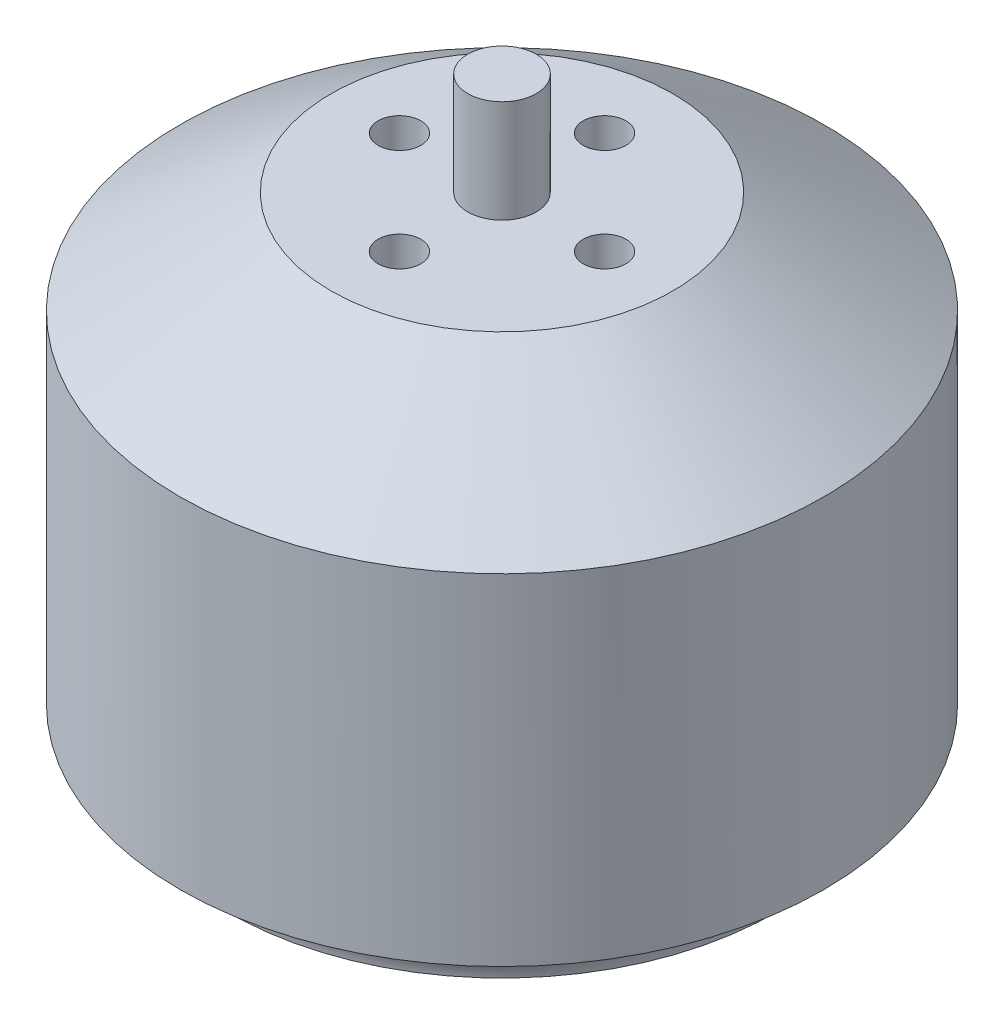
ISO-10303-21;
HEADER;
FILE_DESCRIPTION(('STEP AP214'),'2;1');
FILE_NAME('part.step','',(''),(''),'','','');
FILE_SCHEMA(('AUTOMOTIVE_DESIGN { 1 0 10303 214 1 1 1 1 }'));
ENDSEC;
DATA;
#1=APPLICATION_CONTEXT('core data for automotive mechanical design processes');
#2=APPLICATION_PROTOCOL_DEFINITION('international standard','automotive_design',2000,#1);
#3=PRODUCT_CONTEXT('',#1,'mechanical');
#4=PRODUCT('Part','Part','',(#3));
#5=PRODUCT_RELATED_PRODUCT_CATEGORY('part','',(#4));
#6=PRODUCT_DEFINITION_FORMATION('','',#4);
#7=PRODUCT_DEFINITION_CONTEXT('part definition',#1,'design');
#8=PRODUCT_DEFINITION('design','',#6,#7);
#9=PRODUCT_DEFINITION_SHAPE('','',#8);
#10=(LENGTH_UNIT() NAMED_UNIT(*) SI_UNIT(.MILLI.,.METRE.));
#11=(NAMED_UNIT(*) PLANE_ANGLE_UNIT() SI_UNIT($,.RADIAN.));
#12=(NAMED_UNIT(*) SI_UNIT($,.STERADIAN.) SOLID_ANGLE_UNIT());
#13=UNCERTAINTY_MEASURE_WITH_UNIT(LENGTH_MEASURE(1.E-05),#10,'distance_accuracy_value','');
#14=(GEOMETRIC_REPRESENTATION_CONTEXT(3) GLOBAL_UNCERTAINTY_ASSIGNED_CONTEXT((#13)) GLOBAL_UNIT_ASSIGNED_CONTEXT((#10,
#11,#12)) REPRESENTATION_CONTEXT('',''));
#15=CARTESIAN_POINT('',(0.,0.,0.));
#16=DIRECTION('',(0.,0.,1.));
#17=DIRECTION('',(1.,0.,0.));
#18=AXIS2_PLACEMENT_3D('',#15,#16,#17);
#19=CARTESIAN_POINT('',(0.,0.,0.));
#20=DIRECTION('',(0.,1.,0.));
#21=DIRECTION('',(0.,0.,-1.));
#22=AXIS2_PLACEMENT_3D('',#19,#20,#21);
#23=PLANE('',#22);
#24=CARTESIAN_POINT('',(0.,0.,0.));
#25=DIRECTION('',(0.,-1.,0.));
#26=DIRECTION('',(0.,0.,-1.));
#27=AXIS2_PLACEMENT_3D('',#24,#25,#26);
#28=CIRCLE('',#27,16.);
#29=CARTESIAN_POINT('',(0.,0.,-16.));
#30=VERTEX_POINT('',#29);
#31=EDGE_CURVE('E124',#30,#30,#28,.T.);
#32=ORIENTED_EDGE('',*,*,#31,.T.);
#33=EDGE_LOOP('',(#32));
#34=FACE_BOUND('',#33,.T.);
#35=CARTESIAN_POINT('',(0.,0.,-9.5));
#36=DIRECTION('',(0.,1.,0.));
#37=DIRECTION('',(0.,0.,1.));
#38=AXIS2_PLACEMENT_3D('',#35,#36,#37);
#39=CIRCLE('',#38,1.24999999999999);
#40=CARTESIAN_POINT('',(0.,0.,-8.25000000000001));
#41=VERTEX_POINT('',#40);
#42=EDGE_CURVE('E127',#41,#41,#39,.T.);
#43=ORIENTED_EDGE('',*,*,#42,.T.);
#44=EDGE_LOOP('',(#43));
#45=FACE_BOUND('',#44,.T.);
#46=CARTESIAN_POINT('',(12.5,0.,0.));
#47=DIRECTION('',(0.,1.,0.));
#48=DIRECTION('',(0.,0.,1.));
#49=AXIS2_PLACEMENT_3D('',#46,#47,#48);
#50=CIRCLE('',#49,1.24999999999999);
#51=CARTESIAN_POINT('',(12.5,0.,1.24999999999999));
#52=VERTEX_POINT('',#51);
#53=EDGE_CURVE('E143',#52,#52,#50,.T.);
#54=ORIENTED_EDGE('',*,*,#53,.T.);
#55=EDGE_LOOP('',(#54));
#56=FACE_BOUND('',#55,.T.);
#57=CARTESIAN_POINT('',(0.,0.,9.5));
#58=DIRECTION('',(0.,1.,0.));
#59=DIRECTION('',(0.,0.,1.));
#60=AXIS2_PLACEMENT_3D('',#57,#58,#59);
#61=CIRCLE('',#60,1.24999999999999);
#62=CARTESIAN_POINT('',(0.,0.,10.75));
#63=VERTEX_POINT('',#62);
#64=EDGE_CURVE('E149',#63,#63,#61,.T.);
#65=ORIENTED_EDGE('',*,*,#64,.T.);
#66=EDGE_LOOP('',(#65));
#67=FACE_BOUND('',#66,.T.);
#68=CARTESIAN_POINT('',(-8.,0.,0.));
#69=DIRECTION('',(0.,1.,0.));
#70=DIRECTION('',(0.,0.,1.));
#71=AXIS2_PLACEMENT_3D('',#68,#69,#70);
#72=CIRCLE('',#71,1.24999999999999);
#73=CARTESIAN_POINT('',(-8.,0.,1.24999999999999));
#74=VERTEX_POINT('',#73);
#75=EDGE_CURVE('E155',#74,#74,#72,.T.);
#76=ORIENTED_EDGE('',*,*,#75,.T.);
#77=EDGE_LOOP('',(#76));
#78=FACE_BOUND('',#77,.T.);
#79=CARTESIAN_POINT('',(-12.5,0.,0.));
#80=DIRECTION('',(0.,1.,0.));
#81=DIRECTION('',(0.,0.,1.));
#82=AXIS2_PLACEMENT_3D('',#79,#80,#81);
#83=CIRCLE('',#82,1.24999999999999);
#84=CARTESIAN_POINT('',(-12.5,0.,1.24999999999999));
#85=VERTEX_POINT('',#84);
#86=EDGE_CURVE('E161',#85,#85,#83,.T.);
#87=ORIENTED_EDGE('',*,*,#86,.T.);
#88=EDGE_LOOP('',(#87));
#89=FACE_BOUND('',#88,.T.);
#90=CARTESIAN_POINT('',(0.,0.,0.));
#91=DIRECTION('',(0.,-1.,0.));
#92=DIRECTION('',(0.,0.,-1.));
#93=AXIS2_PLACEMENT_3D('',#90,#91,#92);
#94=CIRCLE('',#93,2.);
#95=CARTESIAN_POINT('',(0.,0.,-2.));
#96=VERTEX_POINT('',#95);
#97=EDGE_CURVE('E11',#96,#96,#94,.F.);
#98=ORIENTED_EDGE('',*,*,#97,.T.);
#99=EDGE_LOOP('',(#98));
#100=FACE_BOUND('',#99,.T.);
#101=CARTESIAN_POINT('',(8.,0.,0.));
#102=DIRECTION('',(0.,1.,0.));
#103=DIRECTION('',(0.,0.,1.));
#104=AXIS2_PLACEMENT_3D('',#101,#102,#103);
#105=CIRCLE('',#104,1.24999999999999);
#106=CARTESIAN_POINT('',(8.,0.,1.24999999999999));
#107=VERTEX_POINT('',#106);
#108=EDGE_CURVE('E137',#107,#107,#105,.T.);
#109=ORIENTED_EDGE('',*,*,#108,.T.);
#110=EDGE_LOOP('',(#109));
#111=FACE_BOUND('',#110,.T.);
#112=ADVANCED_FACE('F47',(#34,#45,#56,#67,#78,#89,#100,#111),#23,.F.);
#113=CARTESIAN_POINT('',(0.,-2.6,0.));
#114=DIRECTION('',(0.,1.,0.));
#115=DIRECTION('',(0.,0.,-1.));
#116=AXIS2_PLACEMENT_3D('',#113,#114,#115);
#117=CYLINDRICAL_SURFACE('',#116,2.);
#118=CARTESIAN_POINT('',(0.,-2.6,0.));
#119=DIRECTION('',(0.,1.,0.));
#120=DIRECTION('',(0.,0.,1.));
#121=AXIS2_PLACEMENT_3D('',#118,#119,#120);
#122=CIRCLE('',#121,2.);
#123=CARTESIAN_POINT('',(0.,-2.6,2.));
#124=VERTEX_POINT('',#123);
#125=EDGE_CURVE('E167',#124,#124,#122,.T.);
#126=ORIENTED_EDGE('',*,*,#125,.T.);
#127=EDGE_LOOP('',(#126));
#128=FACE_BOUND('',#127,.T.);
#129=ORIENTED_EDGE('',*,*,#97,.F.);
#130=EDGE_LOOP('',(#129));
#131=FACE_BOUND('',#130,.T.);
#132=ADVANCED_FACE('F194',(#128,#131),#117,.T.);
#133=CARTESIAN_POINT('',(0.,-2.6,0.));
#134=DIRECTION('',(0.,-1.,0.));
#135=DIRECTION('',(0.,0.,1.));
#136=AXIS2_PLACEMENT_3D('',#133,#134,#135);
#137=PLANE('',#136);
#138=ORIENTED_EDGE('',*,*,#125,.F.);
#139=EDGE_LOOP('',(#138));
#140=FACE_BOUND('',#139,.T.);
#141=ADVANCED_FACE('F199',(#140),#137,.T.);
#142=CARTESIAN_POINT('',(-12.5,1.64892422621555,0.));
#143=DIRECTION('',(0.,-1.,0.));
#144=DIRECTION('',(0.,0.,1.));
#145=AXIS2_PLACEMENT_3D('',#142,#143,#144);
#146=CONICAL_SURFACE('',#145,1.25,1.02974425867665);
#147=CARTESIAN_POINT('',(-12.5,2.4,0.));
#148=VERTEX_POINT('',#147);
#149=VERTEX_LOOP('',#148);
#150=FACE_BOUND('',#149,.T.);
#151=CARTESIAN_POINT('',(-12.5,1.64892422621555,0.));
#152=DIRECTION('',(0.,1.,0.));
#153=DIRECTION('',(0.,0.,1.));
#154=AXIS2_PLACEMENT_3D('',#151,#152,#153);
#155=CIRCLE('',#154,1.25);
#156=CARTESIAN_POINT('',(-12.5,1.64892422621555,1.25));
#157=VERTEX_POINT('',#156);
#158=EDGE_CURVE('E164',#157,#157,#155,.T.);
#159=ORIENTED_EDGE('',*,*,#158,.F.);
#160=EDGE_LOOP('',(#159));
#161=FACE_BOUND('',#160,.T.);
#162=ADVANCED_FACE('F261',(#150,#161),#146,.F.);
#163=CARTESIAN_POINT('',(-12.5,0.,0.));
#164=DIRECTION('',(0.,-1.,0.));
#165=DIRECTION('',(0.,0.,1.));
#166=AXIS2_PLACEMENT_3D('',#163,#164,#165);
#167=CYLINDRICAL_SURFACE('',#166,1.24999999999999);
#168=ORIENTED_EDGE('',*,*,#158,.T.);
#169=EDGE_LOOP('',(#168));
#170=FACE_BOUND('',#169,.T.);
#171=ORIENTED_EDGE('',*,*,#86,.F.);
#172=EDGE_LOOP('',(#171));
#173=FACE_BOUND('',#172,.T.);
#174=ADVANCED_FACE('F258',(#170,#173),#167,.F.);
#175=CARTESIAN_POINT('',(-8.,1.64892422621555,0.));
#176=DIRECTION('',(0.,-1.,0.));
#177=DIRECTION('',(0.,0.,1.));
#178=AXIS2_PLACEMENT_3D('',#175,#176,#177);
#179=CONICAL_SURFACE('',#178,1.25,1.02974425867665);
#180=CARTESIAN_POINT('',(-8.,2.4,0.));
#181=VERTEX_POINT('',#180);
#182=VERTEX_LOOP('',#181);
#183=FACE_BOUND('',#182,.T.);
#184=CARTESIAN_POINT('',(-8.,1.64892422621555,0.));
#185=DIRECTION('',(0.,1.,0.));
#186=DIRECTION('',(0.,0.,1.));
#187=AXIS2_PLACEMENT_3D('',#184,#185,#186);
#188=CIRCLE('',#187,1.25);
#189=CARTESIAN_POINT('',(-8.,1.64892422621555,1.25));
#190=VERTEX_POINT('',#189);
#191=EDGE_CURVE('E158',#190,#190,#188,.T.);
#192=ORIENTED_EDGE('',*,*,#191,.F.);
#193=EDGE_LOOP('',(#192));
#194=FACE_BOUND('',#193,.T.);
#195=ADVANCED_FACE('F254',(#183,#194),#179,.F.);
#196=CARTESIAN_POINT('',(-8.,0.,0.));
#197=DIRECTION('',(0.,-1.,0.));
#198=DIRECTION('',(0.,0.,1.));
#199=AXIS2_PLACEMENT_3D('',#196,#197,#198);
#200=CYLINDRICAL_SURFACE('',#199,1.24999999999999);
#201=ORIENTED_EDGE('',*,*,#191,.T.);
#202=EDGE_LOOP('',(#201));
#203=FACE_BOUND('',#202,.T.);
#204=ORIENTED_EDGE('',*,*,#75,.F.);
#205=EDGE_LOOP('',(#204));
#206=FACE_BOUND('',#205,.T.);
#207=ADVANCED_FACE('F250',(#203,#206),#200,.F.);
#208=CARTESIAN_POINT('',(0.,1.64892422621555,9.5));
#209=DIRECTION('',(0.,-1.,0.));
#210=DIRECTION('',(0.,0.,1.));
#211=AXIS2_PLACEMENT_3D('',#208,#209,#210);
#212=CONICAL_SURFACE('',#211,1.25,1.02974425867665);
#213=CARTESIAN_POINT('',(0.,2.4,9.5));
#214=VERTEX_POINT('',#213);
#215=VERTEX_LOOP('',#214);
#216=FACE_BOUND('',#215,.T.);
#217=CARTESIAN_POINT('',(0.,1.64892422621555,9.5));
#218=DIRECTION('',(0.,1.,0.));
#219=DIRECTION('',(0.,0.,1.));
#220=AXIS2_PLACEMENT_3D('',#217,#218,#219);
#221=CIRCLE('',#220,1.25);
#222=CARTESIAN_POINT('',(0.,1.64892422621555,10.75));
#223=VERTEX_POINT('',#222);
#224=EDGE_CURVE('E152',#223,#223,#221,.T.);
#225=ORIENTED_EDGE('',*,*,#224,.F.);
#226=EDGE_LOOP('',(#225));
#227=FACE_BOUND('',#226,.T.);
#228=ADVANCED_FACE('F246',(#216,#227),#212,.F.);
#229=CARTESIAN_POINT('',(0.,0.,9.5));
#230=DIRECTION('',(0.,-1.,0.));
#231=DIRECTION('',(0.,0.,1.));
#232=AXIS2_PLACEMENT_3D('',#229,#230,#231);
#233=CYLINDRICAL_SURFACE('',#232,1.24999999999999);
#234=ORIENTED_EDGE('',*,*,#224,.T.);
#235=EDGE_LOOP('',(#234));
#236=FACE_BOUND('',#235,.T.);
#237=ORIENTED_EDGE('',*,*,#64,.F.);
#238=EDGE_LOOP('',(#237));
#239=FACE_BOUND('',#238,.T.);
#240=ADVANCED_FACE('F242',(#236,#239),#233,.F.);
#241=CARTESIAN_POINT('',(12.5,1.64892422621555,0.));
#242=DIRECTION('',(0.,-1.,0.));
#243=DIRECTION('',(0.,0.,1.));
#244=AXIS2_PLACEMENT_3D('',#241,#242,#243);
#245=CONICAL_SURFACE('',#244,1.25,1.02974425867665);
#246=CARTESIAN_POINT('',(12.5,2.4,0.));
#247=VERTEX_POINT('',#246);
#248=VERTEX_LOOP('',#247);
#249=FACE_BOUND('',#248,.T.);
#250=CARTESIAN_POINT('',(12.5,1.64892422621555,0.));
#251=DIRECTION('',(0.,1.,0.));
#252=DIRECTION('',(0.,0.,1.));
#253=AXIS2_PLACEMENT_3D('',#250,#251,#252);
#254=CIRCLE('',#253,1.25);
#255=CARTESIAN_POINT('',(12.5,1.64892422621555,1.25));
#256=VERTEX_POINT('',#255);
#257=EDGE_CURVE('E146',#256,#256,#254,.T.);
#258=ORIENTED_EDGE('',*,*,#257,.F.);
#259=EDGE_LOOP('',(#258));
#260=FACE_BOUND('',#259,.T.);
#261=ADVANCED_FACE('F238',(#249,#260),#245,.F.);
#262=CARTESIAN_POINT('',(12.5,0.,0.));
#263=DIRECTION('',(0.,-1.,0.));
#264=DIRECTION('',(0.,0.,1.));
#265=AXIS2_PLACEMENT_3D('',#262,#263,#264);
#266=CYLINDRICAL_SURFACE('',#265,1.24999999999999);
#267=ORIENTED_EDGE('',*,*,#257,.T.);
#268=EDGE_LOOP('',(#267));
#269=FACE_BOUND('',#268,.T.);
#270=ORIENTED_EDGE('',*,*,#53,.F.);
#271=EDGE_LOOP('',(#270));
#272=FACE_BOUND('',#271,.T.);
#273=ADVANCED_FACE('F231',(#269,#272),#266,.F.);
#274=CARTESIAN_POINT('',(8.,1.64892422621555,0.));
#275=DIRECTION('',(0.,-1.,0.));
#276=DIRECTION('',(0.,0.,1.));
#277=AXIS2_PLACEMENT_3D('',#274,#275,#276);
#278=CONICAL_SURFACE('',#277,1.25,1.02974425867665);
#279=CARTESIAN_POINT('',(8.,2.4,0.));
#280=VERTEX_POINT('',#279);
#281=VERTEX_LOOP('',#280);
#282=FACE_BOUND('',#281,.T.);
#283=CARTESIAN_POINT('',(8.,1.64892422621555,0.));
#284=DIRECTION('',(0.,1.,0.));
#285=DIRECTION('',(0.,0.,1.));
#286=AXIS2_PLACEMENT_3D('',#283,#284,#285);
#287=CIRCLE('',#286,1.25);
#288=CARTESIAN_POINT('',(8.,1.64892422621555,1.25));
#289=VERTEX_POINT('',#288);
#290=EDGE_CURVE('E140',#289,#289,#287,.T.);
#291=ORIENTED_EDGE('',*,*,#290,.F.);
#292=EDGE_LOOP('',(#291));
#293=FACE_BOUND('',#292,.T.);
#294=ADVANCED_FACE('F221',(#282,#293),#278,.F.);
#295=CARTESIAN_POINT('',(8.,0.,0.));
#296=DIRECTION('',(0.,-1.,0.));
#297=DIRECTION('',(0.,0.,1.));
#298=AXIS2_PLACEMENT_3D('',#295,#296,#297);
#299=CYLINDRICAL_SURFACE('',#298,1.24999999999999);
#300=ORIENTED_EDGE('',*,*,#290,.T.);
#301=EDGE_LOOP('',(#300));
#302=FACE_BOUND('',#301,.T.);
#303=ORIENTED_EDGE('',*,*,#108,.F.);
#304=EDGE_LOOP('',(#303));
#305=FACE_BOUND('',#304,.T.);
#306=ADVANCED_FACE('F218',(#302,#305),#299,.F.);
#307=CARTESIAN_POINT('',(0.,1.64892422621555,-9.5));
#308=DIRECTION('',(0.,-1.,0.));
#309=DIRECTION('',(0.,0.,1.));
#310=AXIS2_PLACEMENT_3D('',#307,#308,#309);
#311=CONICAL_SURFACE('',#310,1.25,1.02974425867665);
#312=CARTESIAN_POINT('',(0.,2.4,-9.5));
#313=VERTEX_POINT('',#312);
#314=VERTEX_LOOP('',#313);
#315=FACE_BOUND('',#314,.T.);
#316=CARTESIAN_POINT('',(0.,1.64892422621555,-9.5));
#317=DIRECTION('',(0.,1.,0.));
#318=DIRECTION('',(0.,0.,1.));
#319=AXIS2_PLACEMENT_3D('',#316,#317,#318);
#320=CIRCLE('',#319,1.25);
#321=CARTESIAN_POINT('',(0.,1.64892422621555,-8.25));
#322=VERTEX_POINT('',#321);
#323=EDGE_CURVE('E134',#322,#322,#320,.T.);
#324=ORIENTED_EDGE('',*,*,#323,.F.);
#325=EDGE_LOOP('',(#324));
#326=FACE_BOUND('',#325,.T.);
#327=ADVANCED_FACE('F220',(#315,#326),#311,.F.);
#328=CARTESIAN_POINT('',(0.,0.,-9.5));
#329=DIRECTION('',(0.,-1.,0.));
#330=DIRECTION('',(0.,0.,1.));
#331=AXIS2_PLACEMENT_3D('',#328,#329,#330);
#332=CYLINDRICAL_SURFACE('',#331,1.24999999999999);
#333=ORIENTED_EDGE('',*,*,#323,.T.);
#334=EDGE_LOOP('',(#333));
#335=FACE_BOUND('',#334,.T.);
#336=ORIENTED_EDGE('',*,*,#42,.F.);
#337=EDGE_LOOP('',(#336));
#338=FACE_BOUND('',#337,.T.);
#339=ADVANCED_FACE('F228',(#335,#338),#332,.F.);
#340=CARTESIAN_POINT('',(0.,-0.262019230769191,0.));
#341=DIRECTION('',(0.,1.,0.));
#342=DIRECTION('',(0.,0.,-1.));
#343=AXIS2_PLACEMENT_3D('',#340,#341,#342);
#344=TOROIDAL_SURFACE('',#343,18.85,2.8620192307692);
#345=CARTESIAN_POINT('',(0.,2.60000000000002,0.));
#346=DIRECTION('',(0.,-1.,0.));
#347=DIRECTION('',(0.,0.,-1.));
#348=AXIS2_PLACEMENT_3D('',#345,#346,#347);
#349=CIRCLE('',#348,18.85);
#350=CARTESIAN_POINT('',(0.,2.60000000000002,18.85));
#351=VERTEX_POINT('',#350);
#352=EDGE_CURVE('E119',#351,#351,#349,.T.);
#353=ORIENTED_EDGE('',*,*,#352,.T.);
#354=EDGE_LOOP('',(#353));
#355=FACE_BOUND('',#354,.T.);
#356=ORIENTED_EDGE('',*,*,#31,.F.);
#357=EDGE_LOOP('',(#356));
#358=FACE_BOUND('',#357,.T.);
#359=ADVANCED_FACE('F344',(#355,#358),#344,.F.);
#360=CARTESIAN_POINT('',(0.,28.5,0.));
#361=DIRECTION('',(0.,-1.,0.));
#362=DIRECTION('',(0.,0.,1.));
#363=AXIS2_PLACEMENT_3D('',#360,#361,#362);
#364=CYLINDRICAL_SURFACE('',#363,18.85);
#365=CARTESIAN_POINT('',(0.,22.5,0.));
#366=DIRECTION('',(0.,-1.,0.));
#367=DIRECTION('',(0.,0.,-1.));
#368=AXIS2_PLACEMENT_3D('',#365,#366,#367);
#369=CIRCLE('',#368,18.85);
#370=CARTESIAN_POINT('',(0.,22.5,18.85));
#371=VERTEX_POINT('',#370);
#372=EDGE_CURVE('E120',#371,#371,#369,.T.);
#373=CARTESIAN_POINT('',(0.,22.5,18.85));
#374=CARTESIAN_POINT('',(0.,22.2927083333333,18.85));
#375=CARTESIAN_POINT('',(0.,22.0854166666667,18.85));
#376=CARTESIAN_POINT('',(0.,21.6708333333333,18.85));
#377=CARTESIAN_POINT('',(0.,21.4635416666667,18.85));
#378=CARTESIAN_POINT('',(0.,21.0489583333333,18.85));
#379=CARTESIAN_POINT('',(0.,20.8416666666667,18.85));
#380=CARTESIAN_POINT('',(0.,20.4270833333333,18.85));
#381=CARTESIAN_POINT('',(0.,20.2197916666667,18.85));
#382=CARTESIAN_POINT('',(0.,19.8052083333333,18.85));
#383=CARTESIAN_POINT('',(0.,19.5979166666667,18.85));
#384=CARTESIAN_POINT('',(0.,19.1833333333333,18.85));
#385=CARTESIAN_POINT('',(0.,18.9760416666667,18.85));
#386=CARTESIAN_POINT('',(0.,18.5614583333333,18.85));
#387=CARTESIAN_POINT('',(0.,18.3541666666667,18.85));
#388=CARTESIAN_POINT('',(0.,17.9395833333333,18.85));
#389=CARTESIAN_POINT('',(0.,17.7322916666667,18.85));
#390=CARTESIAN_POINT('',(0.,17.3177083333333,18.85));
#391=CARTESIAN_POINT('',(0.,17.1104166666667,18.85));
#392=CARTESIAN_POINT('',(0.,16.6958333333333,18.85));
#393=CARTESIAN_POINT('',(0.,16.4885416666667,18.85));
#394=CARTESIAN_POINT('',(0.,16.0739583333333,18.85));
#395=CARTESIAN_POINT('',(0.,15.8666666666667,18.85));
#396=CARTESIAN_POINT('',(0.,15.4520833333333,18.85));
#397=CARTESIAN_POINT('',(0.,15.2447916666667,18.85));
#398=CARTESIAN_POINT('',(0.,14.8302083333333,18.85));
#399=CARTESIAN_POINT('',(0.,14.6229166666667,18.85));
#400=CARTESIAN_POINT('',(0.,14.2083333333333,18.85));
#401=CARTESIAN_POINT('',(0.,14.0010416666667,18.85));
#402=CARTESIAN_POINT('',(0.,13.5864583333333,18.85));
#403=CARTESIAN_POINT('',(0.,13.3791666666667,18.85));
#404=CARTESIAN_POINT('',(0.,12.9645833333333,18.85));
#405=CARTESIAN_POINT('',(0.,12.7572916666667,18.85));
#406=CARTESIAN_POINT('',(0.,12.3427083333333,18.85));
#407=CARTESIAN_POINT('',(0.,12.1354166666667,18.85));
#408=CARTESIAN_POINT('',(0.,11.7208333333333,18.85));
#409=CARTESIAN_POINT('',(0.,11.5135416666667,18.85));
#410=CARTESIAN_POINT('',(0.,11.0989583333333,18.85));
#411=CARTESIAN_POINT('',(0.,10.8916666666667,18.85));
#412=CARTESIAN_POINT('',(0.,10.4770833333333,18.85));
#413=CARTESIAN_POINT('',(0.,10.2697916666667,18.85));
#414=CARTESIAN_POINT('',(0.,9.85520833333335,18.85));
#415=CARTESIAN_POINT('',(0.,9.64791666666668,18.85));
#416=CARTESIAN_POINT('',(0.,9.23333333333335,18.85));
#417=CARTESIAN_POINT('',(0.,9.02604166666668,18.85));
#418=CARTESIAN_POINT('',(0.,8.61145833333335,18.85));
#419=CARTESIAN_POINT('',(0.,8.40416666666668,18.85));
#420=CARTESIAN_POINT('',(0.,7.98958333333335,18.85));
#421=CARTESIAN_POINT('',(0.,7.78229166666668,18.85));
#422=CARTESIAN_POINT('',(0.,7.36770833333335,18.85));
#423=CARTESIAN_POINT('',(0.,7.16041666666668,18.85));
#424=CARTESIAN_POINT('',(0.,6.74583333333335,18.85));
#425=CARTESIAN_POINT('',(0.,6.53854166666668,18.85));
#426=CARTESIAN_POINT('',(0.,6.12395833333335,18.85));
#427=CARTESIAN_POINT('',(0.,5.91666666666668,18.85));
#428=CARTESIAN_POINT('',(0.,5.50208333333335,18.85));
#429=CARTESIAN_POINT('',(0.,5.29479166666668,18.85));
#430=CARTESIAN_POINT('',(0.,4.88020833333335,18.85));
#431=CARTESIAN_POINT('',(0.,4.67291666666668,18.85));
#432=CARTESIAN_POINT('',(0.,4.25833333333335,18.85));
#433=CARTESIAN_POINT('',(0.,4.05104166666668,18.85));
#434=CARTESIAN_POINT('',(0.,3.63645833333335,18.85));
#435=CARTESIAN_POINT('',(0.,3.42916666666668,18.85));
#436=CARTESIAN_POINT('',(0.,3.01458333333335,18.85));
#437=CARTESIAN_POINT('',(0.,2.80729166666669,18.85));
#438=CARTESIAN_POINT('',(0.,2.60000000000002,18.85));
#439=B_SPLINE_CURVE_WITH_KNOTS('',3,(#373,#374,#375,#376,#377,#378,#379,#380,#381,#382,#383,
#384,#385,#386,#387,#388,#389,#390,#391,#392,#393,#394,#395,#396,#397,#398,#399,#400,#401,#402,
#403,#404,#405,#406,#407,#408,#409,#410,#411,#412,#413,#414,#415,#416,#417,#418,#419,#420,#421,
#422,#423,#424,#425,#426,#427,#428,#429,#430,#431,#432,#433,#434,#435,#436,#437,#438),
.UNSPECIFIED.,.F.,.F.,(4,2,2,2,2,2,2,2,2,2,2,2,2,2,2,2,2,2,2,2,2,2,2,2,2,2,2,2,2,2,2,2,4),(0.,
0.621875000000001,1.24375,1.865625,2.4875,3.109375,3.73124999999999,4.353125,4.975,5.596875,
6.21875,6.840625,7.4625,8.08437499999999,8.70625,9.32812499999999,9.94999999999999,10.571875,
11.19375,11.815625,12.4375,13.059375,13.68125,14.303125,14.925,15.546875,16.16875,16.790625,
17.4125,18.034375,18.65625,19.278125,19.9),.UNSPECIFIED.);
#440=EDGE_CURVE('BSEAM49',#371,#351,#439,.T.);
#441=ORIENTED_EDGE('',*,*,#372,.T.);
#442=ORIENTED_EDGE('',*,*,#352,.F.);
#443=ORIENTED_EDGE('',*,*,#440,.T.);
#444=ORIENTED_EDGE('',*,*,#440,.F.);
#445=EDGE_LOOP('',(#441,#443,#442,#444));
#446=FACE_BOUND('',#445,.T.);
#447=ADVANCED_FACE('F49',(#446),#364,.T.);
#448=CARTESIAN_POINT('',(0.,22.5,0.));
#449=DIRECTION('',(0.,-1.,0.));
#450=DIRECTION('',(0.,0.,1.));
#451=AXIS2_PLACEMENT_3D('',#448,#449,#450);
#452=CONICAL_SURFACE('',#451,18.85,0.975011779171836);
#453=CARTESIAN_POINT('',(0.,28.5,0.));
#454=DIRECTION('',(0.,-1.,0.));
#455=DIRECTION('',(0.,0.,-1.));
#456=AXIS2_PLACEMENT_3D('',#453,#454,#455);
#457=CIRCLE('',#456,10.);
#458=CARTESIAN_POINT('',(0.,28.5,-10.));
#459=VERTEX_POINT('',#458);
#460=EDGE_CURVE('E123',#459,#459,#457,.T.);
#461=ORIENTED_EDGE('',*,*,#460,.T.);
#462=EDGE_LOOP('',(#461));
#463=FACE_BOUND('',#462,.T.);
#464=ORIENTED_EDGE('',*,*,#372,.F.);
#465=EDGE_LOOP('',(#464));
#466=FACE_BOUND('',#465,.T.);
#467=ADVANCED_FACE('F190',(#463,#466),#452,.T.);
#468=CARTESIAN_POINT('',(0.,34.5,0.));
#469=DIRECTION('',(0.,1.,0.));
#470=DIRECTION('',(0.,0.,-1.));
#471=AXIS2_PLACEMENT_3D('',#468,#469,#470);
#472=PLANE('',#471);
#473=CARTESIAN_POINT('',(0.,34.5,0.));
#474=DIRECTION('',(0.,-1.,0.));
#475=DIRECTION('',(0.,0.,-1.));
#476=AXIS2_PLACEMENT_3D('',#473,#474,#475);
#477=CIRCLE('',#476,2.);
#478=CARTESIAN_POINT('',(0.,34.5,-2.));
#479=VERTEX_POINT('',#478);
#480=EDGE_CURVE('E55',#479,#479,#477,.T.);
#481=ORIENTED_EDGE('',*,*,#480,.F.);
#482=EDGE_LOOP('',(#481));
#483=FACE_BOUND('',#482,.T.);
#484=ADVANCED_FACE('F180',(#483),#472,.T.);
#485=CARTESIAN_POINT('',(0.,34.5,0.));
#486=DIRECTION('',(0.,-1.,0.));
#487=DIRECTION('',(0.,0.,1.));
#488=AXIS2_PLACEMENT_3D('',#485,#486,#487);
#489=CYLINDRICAL_SURFACE('',#488,2.);
#490=ORIENTED_EDGE('',*,*,#480,.T.);
#491=EDGE_LOOP('',(#490));
#492=FACE_BOUND('',#491,.T.);
#493=CARTESIAN_POINT('',(0.,28.5,0.));
#494=DIRECTION('',(0.,-1.,0.));
#495=DIRECTION('',(0.,0.,-1.));
#496=AXIS2_PLACEMENT_3D('',#493,#494,#495);
#497=CIRCLE('',#496,2.);
#498=CARTESIAN_POINT('',(0.,28.5,-2.));
#499=VERTEX_POINT('',#498);
#500=EDGE_CURVE('E170',#499,#499,#497,.T.);
#501=ORIENTED_EDGE('',*,*,#500,.F.);
#502=EDGE_LOOP('',(#501));
#503=FACE_BOUND('',#502,.T.);
#504=ADVANCED_FACE('F178',(#492,#503),#489,.T.);
#505=CARTESIAN_POINT('',(0.,28.5,0.));
#506=DIRECTION('',(0.,1.,0.));
#507=DIRECTION('',(0.,0.,-1.));
#508=AXIS2_PLACEMENT_3D('',#505,#506,#507);
#509=PLANE('',#508);
#510=CARTESIAN_POINT('',(0.,28.5,6.));
#511=DIRECTION('',(0.,-1.,0.));
#512=DIRECTION('',(0.,0.,-1.));
#513=AXIS2_PLACEMENT_3D('',#510,#511,#512);
#514=CIRCLE('',#513,1.24999999999999);
#515=CARTESIAN_POINT('',(0.,28.5,4.75000000000001));
#516=VERTEX_POINT('',#515);
#517=EDGE_CURVE('E97',#516,#516,#514,.T.);
#518=ORIENTED_EDGE('',*,*,#517,.T.);
#519=EDGE_LOOP('',(#518));
#520=FACE_BOUND('',#519,.T.);
#521=CARTESIAN_POINT('',(6.,28.5,0.));
#522=DIRECTION('',(0.,-1.,0.));
#523=DIRECTION('',(0.,0.,-1.));
#524=AXIS2_PLACEMENT_3D('',#521,#522,#523);
#525=CIRCLE('',#524,1.24999999999999);
#526=CARTESIAN_POINT('',(6.,28.5,-1.25000000000001));
#527=VERTEX_POINT('',#526);
#528=EDGE_CURVE('E96',#527,#527,#525,.T.);
#529=ORIENTED_EDGE('',*,*,#528,.T.);
#530=EDGE_LOOP('',(#529));
#531=FACE_BOUND('',#530,.T.);
#532=CARTESIAN_POINT('',(0.,28.5,-5.99999999999994));
#533=DIRECTION('',(0.,-1.,0.));
#534=DIRECTION('',(0.,0.,-1.));
#535=AXIS2_PLACEMENT_3D('',#532,#533,#534);
#536=CIRCLE('',#535,1.24999999999999);
#537=CARTESIAN_POINT('',(0.,28.5,-7.24999999999993));
#538=VERTEX_POINT('',#537);
#539=EDGE_CURVE('E107',#538,#538,#536,.T.);
#540=ORIENTED_EDGE('',*,*,#539,.T.);
#541=EDGE_LOOP('',(#540));
#542=FACE_BOUND('',#541,.T.);
#543=CARTESIAN_POINT('',(-6.,28.5,0.));
#544=DIRECTION('',(0.,-1.,0.));
#545=DIRECTION('',(0.,0.,-1.));
#546=AXIS2_PLACEMENT_3D('',#543,#544,#545);
#547=CIRCLE('',#546,1.24999999999999);
#548=CARTESIAN_POINT('',(-6.,28.5,-1.24999999999993));
#549=VERTEX_POINT('',#548);
#550=EDGE_CURVE('E113',#549,#549,#547,.T.);
#551=ORIENTED_EDGE('',*,*,#550,.T.);
#552=EDGE_LOOP('',(#551));
#553=FACE_BOUND('',#552,.T.);
#554=ORIENTED_EDGE('',*,*,#500,.T.);
#555=EDGE_LOOP('',(#554));
#556=FACE_BOUND('',#555,.T.);
#557=ORIENTED_EDGE('',*,*,#460,.F.);
#558=EDGE_LOOP('',(#557));
#559=FACE_BOUND('',#558,.T.);
#560=ADVANCED_FACE('F175',(#520,#531,#542,#553,#556,#559),#509,.T.);
#561=CARTESIAN_POINT('',(-6.,23.2510757737845,0.));
#562=DIRECTION('',(0.,1.,0.));
#563=DIRECTION('',(0.,0.,-1.));
#564=AXIS2_PLACEMENT_3D('',#561,#562,#563);
#565=CONICAL_SURFACE('',#564,1.25,1.02974425867665);
#566=CARTESIAN_POINT('',(-6.,22.5,0.));
#567=VERTEX_POINT('',#566);
#568=VERTEX_LOOP('',#567);
#569=FACE_BOUND('',#568,.T.);
#570=CARTESIAN_POINT('',(-6.,23.2510757737845,0.));
#571=DIRECTION('',(0.,-1.,0.));
#572=DIRECTION('',(0.,0.,-1.));
#573=AXIS2_PLACEMENT_3D('',#570,#571,#572);
#574=CIRCLE('',#573,1.25);
#575=CARTESIAN_POINT('',(-6.,23.2510757737845,-1.24999999999994));
#576=VERTEX_POINT('',#575);
#577=EDGE_CURVE('E116',#576,#576,#574,.T.);
#578=ORIENTED_EDGE('',*,*,#577,.F.);
#579=EDGE_LOOP('',(#578));
#580=FACE_BOUND('',#579,.T.);
#581=ADVANCED_FACE('F187',(#569,#580),#565,.F.);
#582=CARTESIAN_POINT('',(-6.,28.5,0.));
#583=DIRECTION('',(0.,1.,0.));
#584=DIRECTION('',(0.,0.,-1.));
#585=AXIS2_PLACEMENT_3D('',#582,#583,#584);
#586=CYLINDRICAL_SURFACE('',#585,1.24999999999999);
#587=ORIENTED_EDGE('',*,*,#577,.T.);
#588=EDGE_LOOP('',(#587));
#589=FACE_BOUND('',#588,.T.);
#590=ORIENTED_EDGE('',*,*,#550,.F.);
#591=EDGE_LOOP('',(#590));
#592=FACE_BOUND('',#591,.T.);
#593=ADVANCED_FACE('F406',(#589,#592),#586,.F.);
#594=CARTESIAN_POINT('',(0.,23.2510757737845,-5.99999999999994));
#595=DIRECTION('',(0.,1.,0.));
#596=DIRECTION('',(0.,0.,-1.));
#597=AXIS2_PLACEMENT_3D('',#594,#595,#596);
#598=CONICAL_SURFACE('',#597,1.25,1.02974425867665);
#599=CARTESIAN_POINT('',(0.,22.5,-5.99999999999994));
#600=VERTEX_POINT('',#599);
#601=VERTEX_LOOP('',#600);
#602=FACE_BOUND('',#601,.T.);
#603=CARTESIAN_POINT('',(0.,23.2510757737845,-5.99999999999994));
#604=DIRECTION('',(0.,-1.,0.));
#605=DIRECTION('',(0.,0.,-1.));
#606=AXIS2_PLACEMENT_3D('',#603,#604,#605);
#607=CIRCLE('',#606,1.25);
#608=CARTESIAN_POINT('',(0.,23.2510757737845,-7.24999999999994));
#609=VERTEX_POINT('',#608);
#610=EDGE_CURVE('E110',#609,#609,#607,.T.);
#611=ORIENTED_EDGE('',*,*,#610,.F.);
#612=EDGE_LOOP('',(#611));
#613=FACE_BOUND('',#612,.T.);
#614=ADVANCED_FACE('F418',(#602,#613),#598,.F.);
#615=CARTESIAN_POINT('',(0.,28.5,-5.99999999999994));
#616=DIRECTION('',(0.,1.,0.));
#617=DIRECTION('',(0.,0.,-1.));
#618=AXIS2_PLACEMENT_3D('',#615,#616,#617);
#619=CYLINDRICAL_SURFACE('',#618,1.24999999999999);
#620=ORIENTED_EDGE('',*,*,#610,.T.);
#621=EDGE_LOOP('',(#620));
#622=FACE_BOUND('',#621,.T.);
#623=ORIENTED_EDGE('',*,*,#539,.F.);
#624=EDGE_LOOP('',(#623));
#625=FACE_BOUND('',#624,.T.);
#626=ADVANCED_FACE('F431',(#622,#625),#619,.F.);
#627=CARTESIAN_POINT('',(6.,23.2510757737845,0.));
#628=DIRECTION('',(0.,1.,0.));
#629=DIRECTION('',(0.,0.,-1.));
#630=AXIS2_PLACEMENT_3D('',#627,#628,#629);
#631=CONICAL_SURFACE('',#630,1.25,1.02974425867665);
#632=CARTESIAN_POINT('',(6.,22.5,0.));
#633=VERTEX_POINT('',#632);
#634=VERTEX_LOOP('',#633);
#635=FACE_BOUND('',#634,.T.);
#636=CARTESIAN_POINT('',(6.,23.2510757737845,0.));
#637=DIRECTION('',(0.,-1.,0.));
#638=DIRECTION('',(0.,0.,-1.));
#639=AXIS2_PLACEMENT_3D('',#636,#637,#638);
#640=CIRCLE('',#639,1.25);
#641=CARTESIAN_POINT('',(6.,23.2510757737845,-1.25000000000002));
#642=VERTEX_POINT('',#641);
#643=EDGE_CURVE('E100',#642,#642,#640,.T.);
#644=ORIENTED_EDGE('',*,*,#643,.F.);
#645=EDGE_LOOP('',(#644));
#646=FACE_BOUND('',#645,.T.);
#647=ADVANCED_FACE('F443',(#635,#646),#631,.F.);
#648=CARTESIAN_POINT('',(6.,28.5,0.));
#649=DIRECTION('',(0.,1.,0.));
#650=DIRECTION('',(0.,0.,-1.));
#651=AXIS2_PLACEMENT_3D('',#648,#649,#650);
#652=CYLINDRICAL_SURFACE('',#651,1.24999999999999);
#653=ORIENTED_EDGE('',*,*,#643,.T.);
#654=EDGE_LOOP('',(#653));
#655=FACE_BOUND('',#654,.T.);
#656=ORIENTED_EDGE('',*,*,#528,.F.);
#657=EDGE_LOOP('',(#656));
#658=FACE_BOUND('',#657,.T.);
#659=ADVANCED_FACE('F90',(#655,#658),#652,.F.);
#660=CARTESIAN_POINT('',(0.,23.2510757737845,6.));
#661=DIRECTION('',(0.,1.,0.));
#662=DIRECTION('',(0.,0.,-1.));
#663=AXIS2_PLACEMENT_3D('',#660,#661,#662);
#664=CONICAL_SURFACE('',#663,1.25,1.02974425867665);
#665=CARTESIAN_POINT('',(0.,22.5,6.));
#666=VERTEX_POINT('',#665);
#667=VERTEX_LOOP('',#666);
#668=FACE_BOUND('',#667,.T.);
#669=CARTESIAN_POINT('',(0.,23.2510757737845,6.));
#670=DIRECTION('',(0.,-1.,0.));
#671=DIRECTION('',(0.,0.,-1.));
#672=AXIS2_PLACEMENT_3D('',#669,#670,#671);
#673=CIRCLE('',#672,1.25);
#674=CARTESIAN_POINT('',(0.,23.2510757737845,4.75));
#675=VERTEX_POINT('',#674);
#676=EDGE_CURVE('E94',#675,#675,#673,.T.);
#677=ORIENTED_EDGE('',*,*,#676,.F.);
#678=EDGE_LOOP('',(#677));
#679=FACE_BOUND('',#678,.T.);
#680=ADVANCED_FACE('F86',(#668,#679),#664,.F.);
#681=CARTESIAN_POINT('',(0.,28.5,6.));
#682=DIRECTION('',(0.,1.,0.));
#683=DIRECTION('',(0.,0.,-1.));
#684=AXIS2_PLACEMENT_3D('',#681,#682,#683);
#685=CYLINDRICAL_SURFACE('',#684,1.24999999999999);
#686=ORIENTED_EDGE('',*,*,#676,.T.);
#687=EDGE_LOOP('',(#686));
#688=FACE_BOUND('',#687,.T.);
#689=ORIENTED_EDGE('',*,*,#517,.F.);
#690=EDGE_LOOP('',(#689));
#691=FACE_BOUND('',#690,.T.);
#692=ADVANCED_FACE('F89',(#688,#691),#685,.F.);
#693=CLOSED_SHELL('',(#112,#132,#141,#162,#174,#195,#207,#228,#240,#261,#273,#294,#306,#327,
#339,#359,#447,#467,#484,#504,#560,#581,#593,#614,#626,#647,#659,#680,#692));
#694=MANIFOLD_SOLID_BREP('B2',#693);
#695=ADVANCED_BREP_SHAPE_REPRESENTATION('',(#18,#694),#14);
#696=SHAPE_DEFINITION_REPRESENTATION(#9,#695);
ENDSEC;
END-ISO-10303-21;
